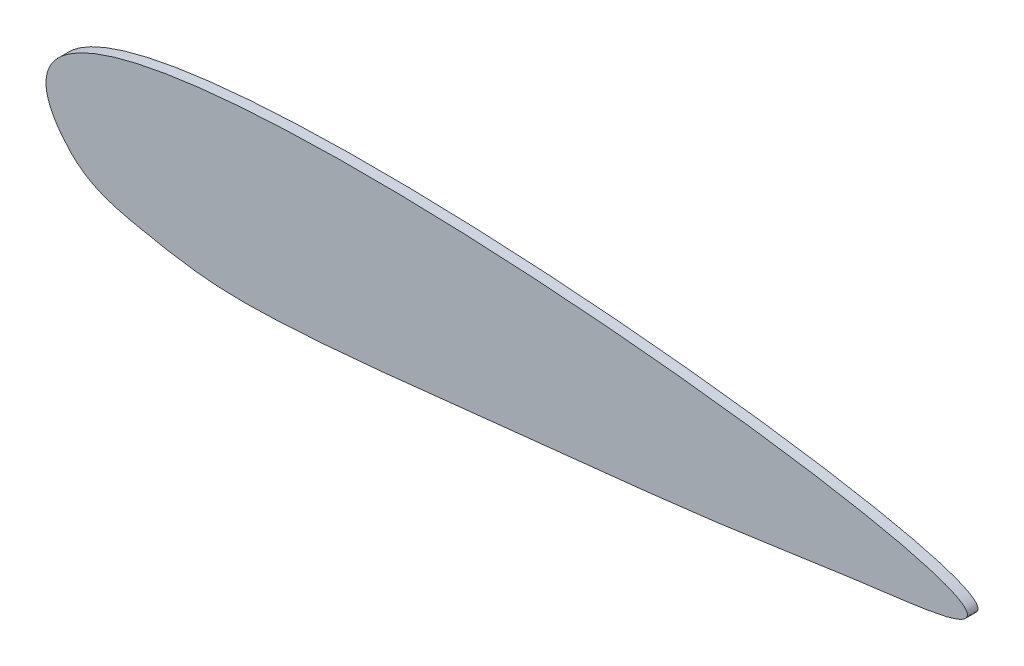
ISO-10303-21;
HEADER;
FILE_DESCRIPTION(('STEP AP214'),'2;1');
FILE_NAME('part.step','',(''),(''),'','','');
FILE_SCHEMA(('AUTOMOTIVE_DESIGN { 1 0 10303 214 1 1 1 1 }'));
ENDSEC;
DATA;
#1=APPLICATION_CONTEXT('core data for automotive mechanical design processes');
#2=APPLICATION_PROTOCOL_DEFINITION('international standard','automotive_design',2000,#1);
#3=PRODUCT_CONTEXT('',#1,'mechanical');
#4=PRODUCT('Part','Part','',(#3));
#5=PRODUCT_RELATED_PRODUCT_CATEGORY('part','',(#4));
#6=PRODUCT_DEFINITION_FORMATION('','',#4);
#7=PRODUCT_DEFINITION_CONTEXT('part definition',#1,'design');
#8=PRODUCT_DEFINITION('design','',#6,#7);
#9=PRODUCT_DEFINITION_SHAPE('','',#8);
#10=(LENGTH_UNIT() NAMED_UNIT(*) SI_UNIT(.MILLI.,.METRE.));
#11=(NAMED_UNIT(*) PLANE_ANGLE_UNIT() SI_UNIT($,.RADIAN.));
#12=(NAMED_UNIT(*) SI_UNIT($,.STERADIAN.) SOLID_ANGLE_UNIT());
#13=UNCERTAINTY_MEASURE_WITH_UNIT(LENGTH_MEASURE(1.E-05),#10,'distance_accuracy_value','');
#14=(GEOMETRIC_REPRESENTATION_CONTEXT(3) GLOBAL_UNCERTAINTY_ASSIGNED_CONTEXT((#13)) GLOBAL_UNIT_ASSIGNED_CONTEXT((#10,
#11,#12)) REPRESENTATION_CONTEXT('',''));
#15=CARTESIAN_POINT('',(0.,0.,0.));
#16=DIRECTION('',(0.,0.,1.));
#17=DIRECTION('',(1.,0.,0.));
#18=AXIS2_PLACEMENT_3D('',#15,#16,#17);
#19=CARTESIAN_POINT('',(0.,0.,3.));
#20=CARTESIAN_POINT('',(1.34681843577083,-1.77431635431959,3.));
#21=CARTESIAN_POINT('',(7.60762180338729,-8.72633093483166,3.));
#22=CARTESIAN_POINT('',(23.0443250362057,-12.2291895619578,3.));
#23=CARTESIAN_POINT('',(42.7965678030784,-15.8059720052179,3.));
#24=CARTESIAN_POINT('',(75.8096387044227,-14.8871956249694,3.));
#25=CARTESIAN_POINT('',(125.053187110581,-8.82529387114122,3.));
#26=CARTESIAN_POINT('',(181.6352203217,-3.56347113883042,3.));
#27=CARTESIAN_POINT('',(222.051389354981,2.98042595131352,3.));
#28=CARTESIAN_POINT('',(341.127697081207,16.7681889219125,3.));
#29=CARTESIAN_POINT('',(-47.4782919978221,62.5485274996867,3.));
#30=CARTESIAN_POINT('',(0.,0.,3.));
#31=B_SPLINE_CURVE_WITH_KNOTS('',3,(#19,#20,#21,#22,#23,#24,#25,#26,#27,#28,#29,#30),
.UNSPECIFIED.,.T.,.F.,(4,1,1,1,1,1,1,1,1,4),(0.,0.0140451528738214,0.0525331178052548,
0.0902555099019488,0.134135357018167,0.247126610148977,0.387170902086809,0.463989086441125,
0.504877679435917,1.),.UNSPECIFIED.);
#32=DIRECTION('',(0.,0.,-1.));
#33=VECTOR('',#32,1.);
#34=SURFACE_OF_LINEAR_EXTRUSION('',#31,#33);
#35=CARTESIAN_POINT('',(0.,0.,3.));
#36=VERTEX_POINT('',#35);
#37=EDGE_CURVE('E10',#36,#36,#31,.T.);
#38=ORIENTED_EDGE('',*,*,#37,.F.);
#39=EDGE_LOOP('',(#38));
#40=FACE_BOUND('',#39,.T.);
#41=CARTESIAN_POINT('',(0.,0.,0.));
#42=CARTESIAN_POINT('',(1.34681843577083,-1.77431635431959,0.));
#43=CARTESIAN_POINT('',(7.60762180338729,-8.72633093483166,0.));
#44=CARTESIAN_POINT('',(23.0443250362057,-12.2291895619578,0.));
#45=CARTESIAN_POINT('',(42.7965678030784,-15.8059720052179,0.));
#46=CARTESIAN_POINT('',(75.8096387044227,-14.8871956249694,0.));
#47=CARTESIAN_POINT('',(125.053187110581,-8.82529387114122,0.));
#48=CARTESIAN_POINT('',(181.6352203217,-3.56347113883042,0.));
#49=CARTESIAN_POINT('',(222.051389354981,2.98042595131352,0.));
#50=CARTESIAN_POINT('',(341.127697081207,16.7681889219125,0.));
#51=CARTESIAN_POINT('',(-47.4782919978221,62.5485274996867,0.));
#52=CARTESIAN_POINT('',(0.,0.,0.));
#53=B_SPLINE_CURVE_WITH_KNOTS('',3,(#41,#42,#43,#44,#45,#46,#47,#48,#49,#50,#51,#52),
.UNSPECIFIED.,.T.,.F.,(4,1,1,1,1,1,1,1,1,4),(0.,0.0140451528738214,0.0525331178052548,
0.0902555099019488,0.134135357018167,0.247126610148977,0.387170902086809,0.463989086441125,
0.504877679435917,1.),.UNSPECIFIED.);
#54=CARTESIAN_POINT('',(0.,0.,0.));
#55=VERTEX_POINT('',#54);
#56=EDGE_CURVE('E41',#55,#55,#53,.T.);
#57=ORIENTED_EDGE('',*,*,#56,.T.);
#58=EDGE_LOOP('',(#57));
#59=FACE_BOUND('',#58,.T.);
#60=ADVANCED_FACE('F37',(#40,#59),#34,.F.);
#61=CARTESIAN_POINT('',(248.066246842331,6.35334462293954,3.));
#62=DIRECTION('',(0.,0.,-1.));
#63=DIRECTION('',(-1.,0.,0.));
#64=AXIS2_PLACEMENT_3D('',#61,#62,#63);
#65=PLANE('',#64);
#66=ORIENTED_EDGE('',*,*,#37,.T.);
#67=EDGE_LOOP('',(#66));
#68=FACE_BOUND('',#67,.T.);
#69=ADVANCED_FACE('F62',(#68),#65,.F.);
#70=CARTESIAN_POINT('',(248.066246842331,6.35334462293954,0.));
#71=DIRECTION('',(0.,0.,-1.));
#72=DIRECTION('',(-1.,0.,0.));
#73=AXIS2_PLACEMENT_3D('',#70,#71,#72);
#74=PLANE('',#73);
#75=ORIENTED_EDGE('',*,*,#56,.F.);
#76=EDGE_LOOP('',(#75));
#77=FACE_BOUND('',#76,.T.);
#78=ADVANCED_FACE('F60',(#77),#74,.T.);
#79=CLOSED_SHELL('',(#60,#69,#78));
#80=MANIFOLD_SOLID_BREP('B2',#79);
#81=ADVANCED_BREP_SHAPE_REPRESENTATION('',(#18,#80),#14);
#82=SHAPE_DEFINITION_REPRESENTATION(#9,#81);
ENDSEC;
END-ISO-10303-21;
